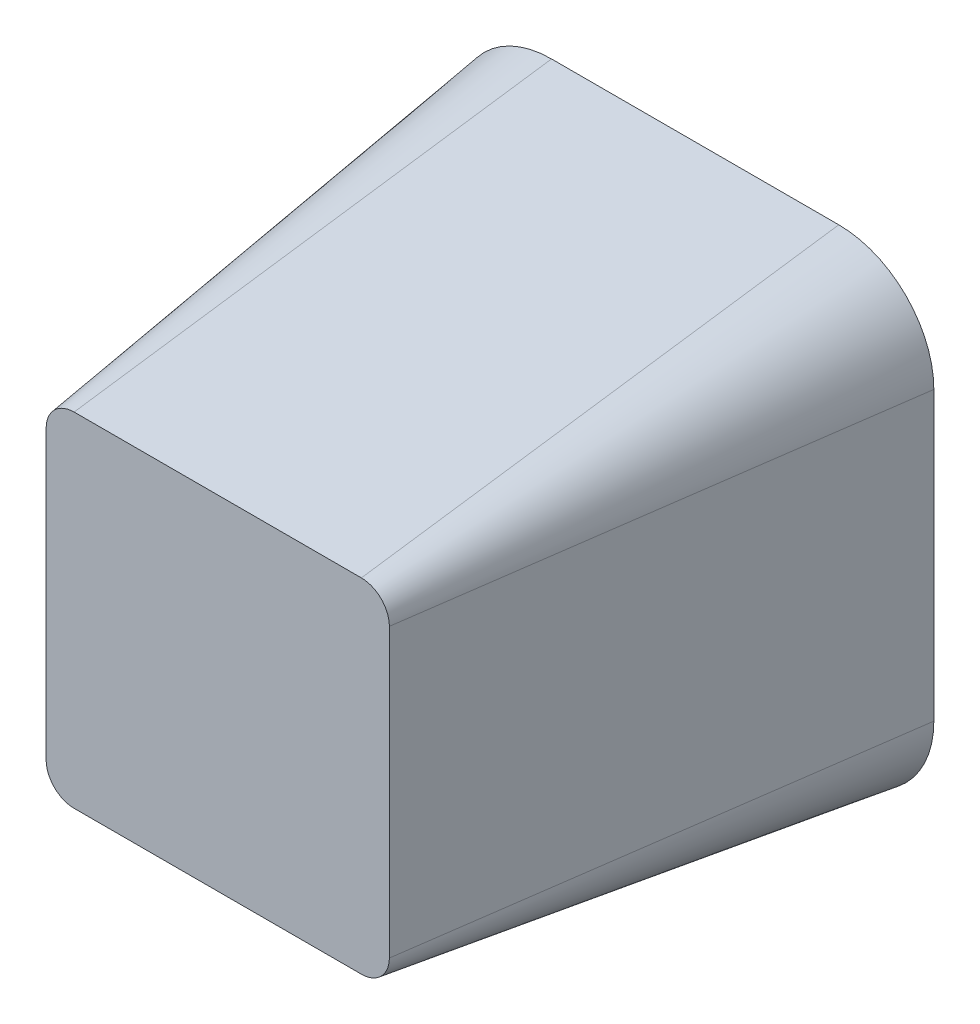
ISO-10303-21;
HEADER;
FILE_DESCRIPTION(('STEP AP214'),'2;1');
FILE_NAME('part.step','',(''),(''),'','','');
FILE_SCHEMA(('AUTOMOTIVE_DESIGN { 1 0 10303 214 1 1 1 1 }'));
ENDSEC;
DATA;
#1=APPLICATION_CONTEXT('core data for automotive mechanical design processes');
#2=APPLICATION_PROTOCOL_DEFINITION('international standard','automotive_design',2000,#1);
#3=PRODUCT_CONTEXT('',#1,'mechanical');
#4=PRODUCT('Part','Part','',(#3));
#5=PRODUCT_RELATED_PRODUCT_CATEGORY('part','',(#4));
#6=PRODUCT_DEFINITION_FORMATION('','',#4);
#7=PRODUCT_DEFINITION_CONTEXT('part definition',#1,'design');
#8=PRODUCT_DEFINITION('design','',#6,#7);
#9=PRODUCT_DEFINITION_SHAPE('','',#8);
#10=(LENGTH_UNIT() NAMED_UNIT(*) SI_UNIT(.MILLI.,.METRE.));
#11=(NAMED_UNIT(*) PLANE_ANGLE_UNIT() SI_UNIT($,.RADIAN.));
#12=(NAMED_UNIT(*) SI_UNIT($,.STERADIAN.) SOLID_ANGLE_UNIT());
#13=UNCERTAINTY_MEASURE_WITH_UNIT(LENGTH_MEASURE(1.E-05),#10,'distance_accuracy_value','');
#14=(GEOMETRIC_REPRESENTATION_CONTEXT(3) GLOBAL_UNCERTAINTY_ASSIGNED_CONTEXT((#13)) GLOBAL_UNIT_ASSIGNED_CONTEXT((#10,
#11,#12)) REPRESENTATION_CONTEXT('',''));
#15=CARTESIAN_POINT('',(0.,0.,0.));
#16=DIRECTION('',(0.,0.,1.));
#17=DIRECTION('',(1.,0.,0.));
#18=AXIS2_PLACEMENT_3D('',#15,#16,#17);
#19=CARTESIAN_POINT('',(1.11111111111108,0.,0.));
#20=DIRECTION('',(0.99026806874157,0.,0.139173100960065));
#21=DIRECTION('',(0.139173100960065,0.,-0.99026806874157));
#22=AXIS2_PLACEMENT_3D('',#19,#20,#21);
#23=PLANE('',#22);
#24=DIRECTION('',(0.,-1.,0.));
#25=VECTOR('',#24,1.);
#26=CARTESIAN_POINT('',(1.11111111111108,0.,0.));
#27=LINE('',#26,#25);
#28=CARTESIAN_POINT('',(1.11111111111108,1.89744652800652,0.));
#29=VERTEX_POINT('',#28);
#30=CARTESIAN_POINT('',(1.11111111111108,-4.11966875022874,0.));
#31=VERTEX_POINT('',#30);
#32=EDGE_CURVE('E114',#29,#31,#27,.T.);
#33=ORIENTED_EDGE('',*,*,#32,.F.);
#34=DIRECTION('',(0.139173100960065,0.,-0.99026806874157));
#35=VECTOR('',#34,1.);
#36=CARTESIAN_POINT('',(1.11111111111108,1.89744652800652,0.));
#37=LINE('',#36,#35);
#38=CARTESIAN_POINT('',(-0.294297235912838,1.89744652800653,10.));
#39=VERTEX_POINT('',#38);
#40=EDGE_CURVE('E11',#39,#29,#37,.T.);
#41=ORIENTED_EDGE('',*,*,#40,.F.);
#42=DIRECTION('',(0.,-1.,0.));
#43=VECTOR('',#42,1.);
#44=CARTESIAN_POINT('',(-0.294297235912837,0.,10.));
#45=LINE('',#44,#43);
#46=CARTESIAN_POINT('',(-0.294297235912837,-4.11966875022875,10.));
#47=VERTEX_POINT('',#46);
#48=EDGE_CURVE('E134',#39,#47,#45,.T.);
#49=ORIENTED_EDGE('',*,*,#48,.T.);
#50=DIRECTION('',(0.139173100960065,0.,-0.99026806874157));
#51=VECTOR('',#50,1.);
#52=CARTESIAN_POINT('',(1.11111111111108,-4.11966875022875,0.));
#53=LINE('',#52,#51);
#54=EDGE_CURVE('E50',#47,#31,#53,.T.);
#55=ORIENTED_EDGE('',*,*,#54,.T.);
#56=EDGE_LOOP('',(#33,#41,#49,#55));
#57=FACE_BOUND('',#56,.T.);
#58=ADVANCED_FACE('F33',(#57),#23,.T.);
#59=CARTESIAN_POINT('',(-0.880331249771276,1.89744652800654,0.));
#60=DIRECTION('',(0.,0.,-1.));
#61=DIRECTION('',(1.,0.,0.));
#62=AXIS2_PLACEMENT_3D('',#59,#60,#61);
#63=CONICAL_SURFACE('',#62,1.99144236088235,0.139626340159546);
#64=CARTESIAN_POINT('',(-0.880331249771276,1.89744652800654,0.));
#65=DIRECTION('',(0.,0.,1.));
#66=DIRECTION('',(1.,0.,0.));
#67=AXIS2_PLACEMENT_3D('',#64,#65,#66);
#68=CIRCLE('',#67,1.99144236088235);
#69=CARTESIAN_POINT('',(-0.88033124977129,3.88888888888889,0.));
#70=VERTEX_POINT('',#69);
#71=EDGE_CURVE('E104',#29,#70,#68,.T.);
#72=ORIENTED_EDGE('',*,*,#71,.T.);
#73=DIRECTION('',(0.,0.139173100960065,-0.99026806874157));
#74=VECTOR('',#73,1.);
#75=CARTESIAN_POINT('',(-0.88033124977129,3.88888888888889,0.));
#76=LINE('',#75,#74);
#77=CARTESIAN_POINT('',(-0.88033124977129,2.48348054186497,10.));
#78=VERTEX_POINT('',#77);
#79=EDGE_CURVE('E42',#78,#70,#76,.T.);
#80=ORIENTED_EDGE('',*,*,#79,.F.);
#81=CARTESIAN_POINT('',(-0.880331249771276,1.89744652800654,10.));
#82=DIRECTION('',(0.,0.,1.));
#83=DIRECTION('',(1.,0.,0.));
#84=AXIS2_PLACEMENT_3D('',#81,#82,#83);
#85=CIRCLE('',#84,0.586034013858438);
#86=EDGE_CURVE('E106',#39,#78,#85,.T.);
#87=ORIENTED_EDGE('',*,*,#86,.F.);
#88=ORIENTED_EDGE('',*,*,#40,.T.);
#89=EDGE_LOOP('',(#72,#80,#87,#88));
#90=FACE_BOUND('',#89,.T.);
#91=ADVANCED_FACE('F35',(#90),#63,.T.);
#92=CARTESIAN_POINT('',(0.,3.88888888888889,0.));
#93=DIRECTION('',(0.,0.99026806874157,0.139173100960065));
#94=DIRECTION('',(0.,-0.139173100960065,0.99026806874157));
#95=AXIS2_PLACEMENT_3D('',#92,#93,#94);
#96=PLANE('',#95);
#97=DIRECTION('',(1.,0.,0.));
#98=VECTOR('',#97,1.);
#99=CARTESIAN_POINT('',(0.,3.88888888888889,0.));
#100=LINE('',#99,#98);
#101=CARTESIAN_POINT('',(-6.89744652800656,3.88888888888889,0.));
#102=VERTEX_POINT('',#101);
#103=EDGE_CURVE('E117',#102,#70,#100,.T.);
#104=ORIENTED_EDGE('',*,*,#103,.F.);
#105=DIRECTION('',(0.,0.139173100960065,-0.99026806874157));
#106=VECTOR('',#105,1.);
#107=CARTESIAN_POINT('',(-6.89744652800656,3.88888888888889,0.));
#108=LINE('',#107,#106);
#109=CARTESIAN_POINT('',(-6.89744652800657,2.48348054186497,10.));
#110=VERTEX_POINT('',#109);
#111=EDGE_CURVE('E146',#110,#102,#108,.T.);
#112=ORIENTED_EDGE('',*,*,#111,.F.);
#113=DIRECTION('',(1.,0.,0.));
#114=VECTOR('',#113,1.);
#115=CARTESIAN_POINT('',(0.,2.48348054186497,10.));
#116=LINE('',#115,#114);
#117=EDGE_CURVE('E151',#110,#78,#116,.T.);
#118=ORIENTED_EDGE('',*,*,#117,.T.);
#119=ORIENTED_EDGE('',*,*,#79,.T.);
#120=EDGE_LOOP('',(#104,#112,#118,#119));
#121=FACE_BOUND('',#120,.T.);
#122=ADVANCED_FACE('F164',(#121),#96,.T.);
#123=CARTESIAN_POINT('',(-6.89744652800657,1.89744652800654,0.));
#124=DIRECTION('',(0.,0.,-1.));
#125=DIRECTION('',(1.,0.,0.));
#126=AXIS2_PLACEMENT_3D('',#123,#124,#125);
#127=CONICAL_SURFACE('',#126,1.99144236088235,0.139626340159546);
#128=CARTESIAN_POINT('',(-6.89744652800657,1.89744652800654,0.));
#129=DIRECTION('',(0.,0.,1.));
#130=DIRECTION('',(1.,0.,0.));
#131=AXIS2_PLACEMENT_3D('',#128,#129,#130);
#132=CIRCLE('',#131,1.99144236088235);
#133=CARTESIAN_POINT('',(-8.88888888888892,1.89744652800652,0.));
#134=VERTEX_POINT('',#133);
#135=EDGE_CURVE('E122',#102,#134,#132,.T.);
#136=ORIENTED_EDGE('',*,*,#135,.T.);
#137=DIRECTION('',(-0.139173100960065,0.,-0.99026806874157));
#138=VECTOR('',#137,1.);
#139=CARTESIAN_POINT('',(-8.88888888888892,1.89744652800652,0.));
#140=LINE('',#139,#138);
#141=CARTESIAN_POINT('',(-7.48348054186501,1.89744652800652,10.));
#142=VERTEX_POINT('',#141);
#143=EDGE_CURVE('E143',#142,#134,#140,.T.);
#144=ORIENTED_EDGE('',*,*,#143,.F.);
#145=CARTESIAN_POINT('',(-6.89744652800657,1.89744652800654,10.));
#146=DIRECTION('',(0.,0.,1.));
#147=DIRECTION('',(1.,0.,0.));
#148=AXIS2_PLACEMENT_3D('',#145,#146,#147);
#149=CIRCLE('',#148,0.586034013858438);
#150=EDGE_CURVE('E154',#110,#142,#149,.T.);
#151=ORIENTED_EDGE('',*,*,#150,.F.);
#152=ORIENTED_EDGE('',*,*,#111,.T.);
#153=EDGE_LOOP('',(#136,#144,#151,#152));
#154=FACE_BOUND('',#153,.T.);
#155=ADVANCED_FACE('F168',(#154),#127,.T.);
#156=CARTESIAN_POINT('',(-8.88888888888892,0.,0.));
#157=DIRECTION('',(-0.99026806874157,0.,0.139173100960065));
#158=DIRECTION('',(0.139173100960065,0.,0.99026806874157));
#159=AXIS2_PLACEMENT_3D('',#156,#157,#158);
#160=PLANE('',#159);
#161=DIRECTION('',(0.,-1.,0.));
#162=VECTOR('',#161,1.);
#163=CARTESIAN_POINT('',(-8.88888888888892,0.,0.));
#164=LINE('',#163,#162);
#165=CARTESIAN_POINT('',(-8.88888888888892,-4.11966875022875,0.));
#166=VERTEX_POINT('',#165);
#167=EDGE_CURVE('E124',#134,#166,#164,.T.);
#168=ORIENTED_EDGE('',*,*,#167,.T.);
#169=DIRECTION('',(-0.139173100960065,0.,-0.99026806874157));
#170=VECTOR('',#169,1.);
#171=CARTESIAN_POINT('',(-8.88888888888892,-4.11966875022875,0.));
#172=LINE('',#171,#170);
#173=CARTESIAN_POINT('',(-7.48348054186501,-4.11966875022876,10.));
#174=VERTEX_POINT('',#173);
#175=EDGE_CURVE('E141',#174,#166,#172,.T.);
#176=ORIENTED_EDGE('',*,*,#175,.F.);
#177=DIRECTION('',(0.,1.,0.));
#178=VECTOR('',#177,1.);
#179=CARTESIAN_POINT('',(-7.48348054186501,0.,10.));
#180=LINE('',#179,#178);
#181=EDGE_CURVE('E156',#142,#174,#180,.F.);
#182=ORIENTED_EDGE('',*,*,#181,.F.);
#183=ORIENTED_EDGE('',*,*,#143,.T.);
#184=EDGE_LOOP('',(#168,#176,#182,#183));
#185=FACE_BOUND('',#184,.T.);
#186=ADVANCED_FACE('F172',(#185),#160,.T.);
#187=CARTESIAN_POINT('',(-6.89744652800657,-4.11966875022876,0.));
#188=DIRECTION('',(0.,0.,-1.));
#189=DIRECTION('',(1.,0.,0.));
#190=AXIS2_PLACEMENT_3D('',#187,#188,#189);
#191=CONICAL_SURFACE('',#190,1.99144236088235,0.139626340159546);
#192=CARTESIAN_POINT('',(-6.89744652800657,-4.11966875022876,0.));
#193=DIRECTION('',(0.,0.,1.));
#194=DIRECTION('',(1.,0.,0.));
#195=AXIS2_PLACEMENT_3D('',#192,#193,#194);
#196=CIRCLE('',#195,1.99144236088235);
#197=CARTESIAN_POINT('',(-6.89744652800656,-6.11111111111111,0.));
#198=VERTEX_POINT('',#197);
#199=EDGE_CURVE('E127',#198,#166,#196,.F.);
#200=ORIENTED_EDGE('',*,*,#199,.F.);
#201=DIRECTION('',(0.,-0.139173100960065,-0.99026806874157));
#202=VECTOR('',#201,1.);
#203=CARTESIAN_POINT('',(-6.89744652800656,-6.11111111111111,0.));
#204=LINE('',#203,#202);
#205=CARTESIAN_POINT('',(-6.89744652800656,-4.7057027640872,10.));
#206=VERTEX_POINT('',#205);
#207=EDGE_CURVE('E139',#206,#198,#204,.T.);
#208=ORIENTED_EDGE('',*,*,#207,.F.);
#209=CARTESIAN_POINT('',(-6.89744652800657,-4.11966875022876,10.));
#210=DIRECTION('',(0.,0.,1.));
#211=DIRECTION('',(1.,0.,0.));
#212=AXIS2_PLACEMENT_3D('',#209,#210,#211);
#213=CIRCLE('',#212,0.586034013858438);
#214=EDGE_CURVE('E158',#206,#174,#213,.F.);
#215=ORIENTED_EDGE('',*,*,#214,.T.);
#216=ORIENTED_EDGE('',*,*,#175,.T.);
#217=EDGE_LOOP('',(#200,#208,#215,#216));
#218=FACE_BOUND('',#217,.T.);
#219=ADVANCED_FACE('F176',(#218),#191,.T.);
#220=CARTESIAN_POINT('',(0.,-6.11111111111111,0.));
#221=DIRECTION('',(0.,-0.99026806874157,0.139173100960065));
#222=DIRECTION('',(0.,-0.139173100960065,-0.99026806874157));
#223=AXIS2_PLACEMENT_3D('',#220,#221,#222);
#224=PLANE('',#223);
#225=DIRECTION('',(1.,0.,0.));
#226=VECTOR('',#225,1.);
#227=CARTESIAN_POINT('',(0.,-6.11111111111111,0.));
#228=LINE('',#227,#226);
#229=CARTESIAN_POINT('',(-0.880331249771289,-6.11111111111111,0.));
#230=VERTEX_POINT('',#229);
#231=EDGE_CURVE('E130',#198,#230,#228,.T.);
#232=ORIENTED_EDGE('',*,*,#231,.T.);
#233=DIRECTION('',(0.,-0.139173100960065,-0.99026806874157));
#234=VECTOR('',#233,1.);
#235=CARTESIAN_POINT('',(-0.880331249771289,-6.11111111111111,0.));
#236=LINE('',#235,#234);
#237=CARTESIAN_POINT('',(-0.880331249771278,-4.7057027640872,10.));
#238=VERTEX_POINT('',#237);
#239=EDGE_CURVE('E137',#238,#230,#236,.T.);
#240=ORIENTED_EDGE('',*,*,#239,.F.);
#241=DIRECTION('',(-1.,0.,0.));
#242=VECTOR('',#241,1.);
#243=CARTESIAN_POINT('',(0.,-4.7057027640872,10.));
#244=LINE('',#243,#242);
#245=EDGE_CURVE('E58',#206,#238,#244,.F.);
#246=ORIENTED_EDGE('',*,*,#245,.F.);
#247=ORIENTED_EDGE('',*,*,#207,.T.);
#248=EDGE_LOOP('',(#232,#240,#246,#247));
#249=FACE_BOUND('',#248,.T.);
#250=ADVANCED_FACE('F179',(#249),#224,.T.);
#251=CARTESIAN_POINT('',(-0.880331249771274,-4.11966875022876,0.));
#252=DIRECTION('',(0.,0.,-1.));
#253=DIRECTION('',(1.,0.,0.));
#254=AXIS2_PLACEMENT_3D('',#251,#252,#253);
#255=CONICAL_SURFACE('',#254,1.99144236088235,0.139626340159546);
#256=CARTESIAN_POINT('',(-0.880331249771274,-4.11966875022876,0.));
#257=DIRECTION('',(0.,0.,1.));
#258=DIRECTION('',(1.,0.,0.));
#259=AXIS2_PLACEMENT_3D('',#256,#257,#258);
#260=CIRCLE('',#259,1.99144236088235);
#261=EDGE_CURVE('E133',#31,#230,#260,.F.);
#262=ORIENTED_EDGE('',*,*,#261,.F.);
#263=ORIENTED_EDGE('',*,*,#54,.F.);
#264=CARTESIAN_POINT('',(-0.880331249771274,-4.11966875022876,10.));
#265=DIRECTION('',(0.,0.,1.));
#266=DIRECTION('',(1.,0.,0.));
#267=AXIS2_PLACEMENT_3D('',#264,#265,#266);
#268=CIRCLE('',#267,0.586034013858438);
#269=EDGE_CURVE('E37',#47,#238,#268,.F.);
#270=ORIENTED_EDGE('',*,*,#269,.T.);
#271=ORIENTED_EDGE('',*,*,#239,.T.);
#272=EDGE_LOOP('',(#262,#263,#270,#271));
#273=FACE_BOUND('',#272,.T.);
#274=ADVANCED_FACE('F160',(#273),#255,.T.);
#275=CARTESIAN_POINT('',(0.,0.,10.));
#276=DIRECTION('',(0.,0.,1.));
#277=DIRECTION('',(1.,0.,0.));
#278=AXIS2_PLACEMENT_3D('',#275,#276,#277);
#279=PLANE('',#278);
#280=ORIENTED_EDGE('',*,*,#48,.F.);
#281=ORIENTED_EDGE('',*,*,#86,.T.);
#282=ORIENTED_EDGE('',*,*,#117,.F.);
#283=ORIENTED_EDGE('',*,*,#150,.T.);
#284=ORIENTED_EDGE('',*,*,#181,.T.);
#285=ORIENTED_EDGE('',*,*,#214,.F.);
#286=ORIENTED_EDGE('',*,*,#245,.T.);
#287=ORIENTED_EDGE('',*,*,#269,.F.);
#288=EDGE_LOOP('',(#280,#281,#282,#283,#284,#285,#286,#287));
#289=FACE_BOUND('',#288,.T.);
#290=ADVANCED_FACE('F161',(#289),#279,.T.);
#291=CARTESIAN_POINT('',(0.,0.,0.));
#292=DIRECTION('',(0.,0.,1.));
#293=DIRECTION('',(1.,0.,0.));
#294=AXIS2_PLACEMENT_3D('',#291,#292,#293);
#295=PLANE('',#294);
#296=ORIENTED_EDGE('',*,*,#32,.T.);
#297=ORIENTED_EDGE('',*,*,#261,.T.);
#298=ORIENTED_EDGE('',*,*,#231,.F.);
#299=ORIENTED_EDGE('',*,*,#199,.T.);
#300=ORIENTED_EDGE('',*,*,#167,.F.);
#301=ORIENTED_EDGE('',*,*,#135,.F.);
#302=ORIENTED_EDGE('',*,*,#103,.T.);
#303=ORIENTED_EDGE('',*,*,#71,.F.);
#304=EDGE_LOOP('',(#296,#297,#298,#299,#300,#301,#302,#303));
#305=FACE_BOUND('',#304,.T.);
#306=ADVANCED_FACE('F112',(#305),#295,.F.);
#307=CLOSED_SHELL('',(#58,#91,#122,#155,#186,#219,#250,#274,#290,#306));
#308=MANIFOLD_SOLID_BREP('B2',#307);
#309=ADVANCED_BREP_SHAPE_REPRESENTATION('',(#18,#308),#14);
#310=SHAPE_DEFINITION_REPRESENTATION(#9,#309);
ENDSEC;
END-ISO-10303-21;
